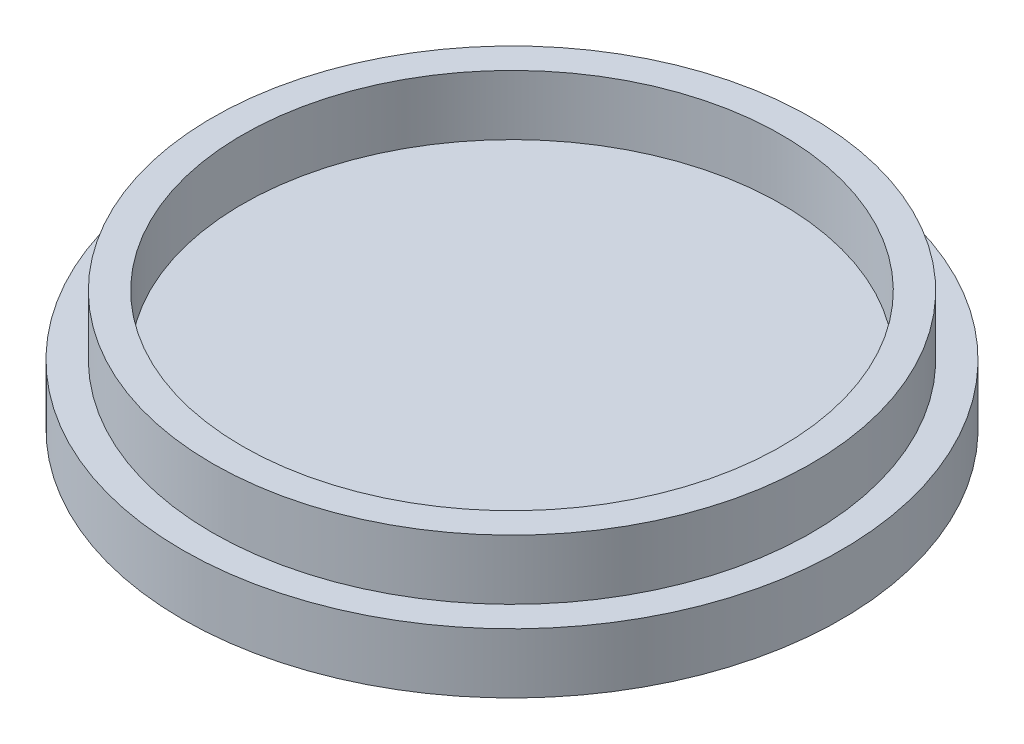
ISO-10303-21;
HEADER;
FILE_DESCRIPTION(('STEP AP214'),'2;1');
FILE_NAME('part.step','',(''),(''),'','','');
FILE_SCHEMA(('AUTOMOTIVE_DESIGN { 1 0 10303 214 1 1 1 1 }'));
ENDSEC;
DATA;
#1=APPLICATION_CONTEXT('core data for automotive mechanical design processes');
#2=APPLICATION_PROTOCOL_DEFINITION('international standard','automotive_design',2000,#1);
#3=PRODUCT_CONTEXT('',#1,'mechanical');
#4=PRODUCT('Part','Part','',(#3));
#5=PRODUCT_RELATED_PRODUCT_CATEGORY('part','',(#4));
#6=PRODUCT_DEFINITION_FORMATION('','',#4);
#7=PRODUCT_DEFINITION_CONTEXT('part definition',#1,'design');
#8=PRODUCT_DEFINITION('design','',#6,#7);
#9=PRODUCT_DEFINITION_SHAPE('','',#8);
#10=(LENGTH_UNIT() NAMED_UNIT(*) SI_UNIT(.MILLI.,.METRE.));
#11=(NAMED_UNIT(*) PLANE_ANGLE_UNIT() SI_UNIT($,.RADIAN.));
#12=(NAMED_UNIT(*) SI_UNIT($,.STERADIAN.) SOLID_ANGLE_UNIT());
#13=UNCERTAINTY_MEASURE_WITH_UNIT(LENGTH_MEASURE(1.E-05),#10,'distance_accuracy_value','');
#14=(GEOMETRIC_REPRESENTATION_CONTEXT(3) GLOBAL_UNCERTAINTY_ASSIGNED_CONTEXT((#13)) GLOBAL_UNIT_ASSIGNED_CONTEXT((#10,
#11,#12)) REPRESENTATION_CONTEXT('',''));
#15=CARTESIAN_POINT('',(0.,0.,0.));
#16=DIRECTION('',(0.,0.,1.));
#17=DIRECTION('',(1.,0.,0.));
#18=AXIS2_PLACEMENT_3D('',#15,#16,#17);
#19=CARTESIAN_POINT('',(0.,5.,0.));
#20=DIRECTION('',(0.,-1.,0.));
#21=DIRECTION('',(0.,0.,-1.));
#22=AXIS2_PLACEMENT_3D('',#19,#20,#21);
#23=CYLINDRICAL_SURFACE('',#22,27.5);
#24=CARTESIAN_POINT('',(0.,5.,0.));
#25=DIRECTION('',(0.,1.,0.));
#26=DIRECTION('',(0.,0.,1.));
#27=AXIS2_PLACEMENT_3D('',#24,#25,#26);
#28=CIRCLE('',#27,27.5);
#29=CARTESIAN_POINT('',(0.,5.,27.5));
#30=VERTEX_POINT('',#29);
#31=EDGE_CURVE('E39',#30,#30,#28,.T.);
#32=ORIENTED_EDGE('',*,*,#31,.F.);
#33=EDGE_LOOP('',(#32));
#34=FACE_BOUND('',#33,.T.);
#35=CARTESIAN_POINT('',(0.,0.,0.));
#36=DIRECTION('',(0.,1.,0.));
#37=DIRECTION('',(0.,0.,1.));
#38=AXIS2_PLACEMENT_3D('',#35,#36,#37);
#39=CIRCLE('',#38,27.5);
#40=CARTESIAN_POINT('',(0.,0.,27.5));
#41=VERTEX_POINT('',#40);
#42=EDGE_CURVE('E43',#41,#41,#39,.T.);
#43=ORIENTED_EDGE('',*,*,#42,.T.);
#44=EDGE_LOOP('',(#43));
#45=FACE_BOUND('',#44,.T.);
#46=ADVANCED_FACE('F33',(#34,#45),#23,.T.);
#47=CARTESIAN_POINT('',(0.,5.,0.));
#48=DIRECTION('',(0.,1.,0.));
#49=DIRECTION('',(0.,0.,1.));
#50=AXIS2_PLACEMENT_3D('',#47,#48,#49);
#51=PLANE('',#50);
#52=CARTESIAN_POINT('',(0.,5.,0.));
#53=DIRECTION('',(0.,1.,0.));
#54=DIRECTION('',(0.,0.,1.));
#55=AXIS2_PLACEMENT_3D('',#52,#53,#54);
#56=CIRCLE('',#55,25.);
#57=CARTESIAN_POINT('',(0.,5.,25.));
#58=VERTEX_POINT('',#57);
#59=EDGE_CURVE('E50',#58,#58,#56,.T.);
#60=ORIENTED_EDGE('',*,*,#59,.F.);
#61=EDGE_LOOP('',(#60));
#62=FACE_BOUND('',#61,.T.);
#63=ORIENTED_EDGE('',*,*,#31,.T.);
#64=EDGE_LOOP('',(#63));
#65=FACE_BOUND('',#64,.T.);
#66=ADVANCED_FACE('F73',(#62,#65),#51,.T.);
#67=CARTESIAN_POINT('',(0.,0.,0.));
#68=DIRECTION('',(0.,1.,0.));
#69=DIRECTION('',(0.,0.,1.));
#70=AXIS2_PLACEMENT_3D('',#67,#68,#69);
#71=PLANE('',#70);
#72=ORIENTED_EDGE('',*,*,#42,.F.);
#73=EDGE_LOOP('',(#72));
#74=FACE_BOUND('',#73,.T.);
#75=ADVANCED_FACE('F64',(#74),#71,.F.);
#76=CARTESIAN_POINT('',(0.,10.,0.));
#77=DIRECTION('',(0.,1.,0.));
#78=DIRECTION('',(0.,0.,1.));
#79=AXIS2_PLACEMENT_3D('',#76,#77,#78);
#80=PLANE('',#79);
#81=CARTESIAN_POINT('',(0.,10.,0.));
#82=DIRECTION('',(0.,1.,0.));
#83=DIRECTION('',(0.,0.,1.));
#84=AXIS2_PLACEMENT_3D('',#81,#82,#83);
#85=CIRCLE('',#84,25.);
#86=CARTESIAN_POINT('',(0.,10.,25.));
#87=VERTEX_POINT('',#86);
#88=EDGE_CURVE('E48',#87,#87,#85,.T.);
#89=ORIENTED_EDGE('',*,*,#88,.T.);
#90=EDGE_LOOP('',(#89));
#91=FACE_BOUND('',#90,.T.);
#92=CARTESIAN_POINT('',(0.,10.,0.));
#93=DIRECTION('',(0.,1.,0.));
#94=DIRECTION('',(0.,0.,1.));
#95=AXIS2_PLACEMENT_3D('',#92,#93,#94);
#96=CIRCLE('',#95,22.5);
#97=CARTESIAN_POINT('',(0.,10.,22.5));
#98=VERTEX_POINT('',#97);
#99=EDGE_CURVE('E53',#98,#98,#96,.T.);
#100=ORIENTED_EDGE('',*,*,#99,.F.);
#101=EDGE_LOOP('',(#100));
#102=FACE_BOUND('',#101,.T.);
#103=ADVANCED_FACE('F61',(#91,#102),#80,.T.);
#104=CARTESIAN_POINT('',(0.,10.,0.));
#105=DIRECTION('',(0.,-1.,0.));
#106=DIRECTION('',(0.,0.,-1.));
#107=AXIS2_PLACEMENT_3D('',#104,#105,#106);
#108=CYLINDRICAL_SURFACE('',#107,25.);
#109=ORIENTED_EDGE('',*,*,#88,.F.);
#110=EDGE_LOOP('',(#109));
#111=FACE_BOUND('',#110,.T.);
#112=ORIENTED_EDGE('',*,*,#59,.T.);
#113=EDGE_LOOP('',(#112));
#114=FACE_BOUND('',#113,.T.);
#115=ADVANCED_FACE('F63',(#111,#114),#108,.T.);
#116=CARTESIAN_POINT('',(0.,10.,0.));
#117=DIRECTION('',(0.,-1.,0.));
#118=DIRECTION('',(0.,0.,-1.));
#119=AXIS2_PLACEMENT_3D('',#116,#117,#118);
#120=CYLINDRICAL_SURFACE('',#119,22.5);
#121=ORIENTED_EDGE('',*,*,#99,.T.);
#122=EDGE_LOOP('',(#121));
#123=FACE_BOUND('',#122,.T.);
#124=CARTESIAN_POINT('',(0.,5.,0.));
#125=DIRECTION('',(0.,1.,0.));
#126=DIRECTION('',(0.,0.,1.));
#127=AXIS2_PLACEMENT_3D('',#124,#125,#126);
#128=CIRCLE('',#127,22.5);
#129=CARTESIAN_POINT('',(0.,5.,22.5));
#130=VERTEX_POINT('',#129);
#131=EDGE_CURVE('E10',#130,#130,#128,.F.);
#132=ORIENTED_EDGE('',*,*,#131,.T.);
#133=EDGE_LOOP('',(#132));
#134=FACE_BOUND('',#133,.T.);
#135=ADVANCED_FACE('F59',(#123,#134),#120,.F.);
#136=ORIENTED_EDGE('',*,*,#131,.F.);
#137=EDGE_LOOP('',(#136));
#138=FACE_BOUND('',#137,.T.);
#139=ADVANCED_FACE('F83',(#138),#51,.T.);
#140=CLOSED_SHELL('',(#46,#66,#75,#103,#115,#135,#139));
#141=MANIFOLD_SOLID_BREP('B2',#140);
#142=ADVANCED_BREP_SHAPE_REPRESENTATION('',(#18,#141),#14);
#143=SHAPE_DEFINITION_REPRESENTATION(#9,#142);
ENDSEC;
END-ISO-10303-21;
